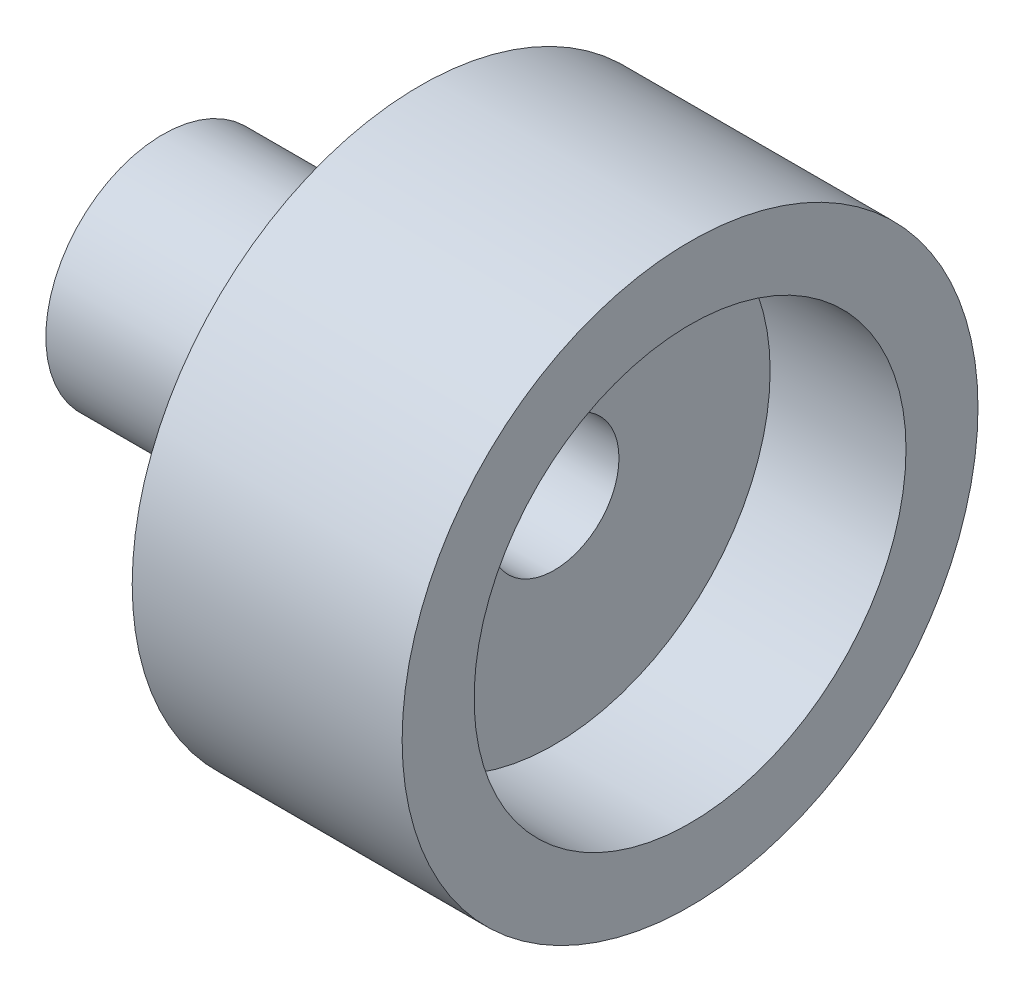
ISO-10303-21;
HEADER;
FILE_DESCRIPTION(('STEP AP214'),'2;1');
FILE_NAME('part.step','',(''),(''),'','','');
FILE_SCHEMA(('AUTOMOTIVE_DESIGN { 1 0 10303 214 1 1 1 1 }'));
ENDSEC;
DATA;
#1=APPLICATION_CONTEXT('core data for automotive mechanical design processes');
#2=APPLICATION_PROTOCOL_DEFINITION('international standard','automotive_design',2000,#1);
#3=PRODUCT_CONTEXT('',#1,'mechanical');
#4=PRODUCT('Part','Part','',(#3));
#5=PRODUCT_RELATED_PRODUCT_CATEGORY('part','',(#4));
#6=PRODUCT_DEFINITION_FORMATION('','',#4);
#7=PRODUCT_DEFINITION_CONTEXT('part definition',#1,'design');
#8=PRODUCT_DEFINITION('design','',#6,#7);
#9=PRODUCT_DEFINITION_SHAPE('','',#8);
#10=(LENGTH_UNIT() NAMED_UNIT(*) SI_UNIT(.MILLI.,.METRE.));
#11=(NAMED_UNIT(*) PLANE_ANGLE_UNIT() SI_UNIT($,.RADIAN.));
#12=(NAMED_UNIT(*) SI_UNIT($,.STERADIAN.) SOLID_ANGLE_UNIT());
#13=UNCERTAINTY_MEASURE_WITH_UNIT(LENGTH_MEASURE(1.E-05),#10,'distance_accuracy_value','');
#14=(GEOMETRIC_REPRESENTATION_CONTEXT(3) GLOBAL_UNCERTAINTY_ASSIGNED_CONTEXT((#13)) GLOBAL_UNIT_ASSIGNED_CONTEXT((#10,
#11,#12)) REPRESENTATION_CONTEXT('',''));
#15=CARTESIAN_POINT('',(0.,0.,0.));
#16=DIRECTION('',(0.,0.,1.));
#17=DIRECTION('',(1.,0.,0.));
#18=AXIS2_PLACEMENT_3D('',#15,#16,#17);
#19=CARTESIAN_POINT('',(7.5,0.,0.));
#20=DIRECTION('',(1.,0.,0.));
#21=DIRECTION('',(0.,0.,-1.));
#22=AXIS2_PLACEMENT_3D('',#19,#20,#21);
#23=PLANE('',#22);
#24=CARTESIAN_POINT('',(7.5,0.,0.));
#25=DIRECTION('',(1.,0.,0.));
#26=DIRECTION('',(0.,0.,-1.));
#27=AXIS2_PLACEMENT_3D('',#24,#25,#26);
#28=CIRCLE('',#27,6.);
#29=CARTESIAN_POINT('',(7.5,0.,-6.));
#30=VERTEX_POINT('',#29);
#31=EDGE_CURVE('E48',#30,#30,#28,.T.);
#32=ORIENTED_EDGE('',*,*,#31,.F.);
#33=EDGE_LOOP('',(#32));
#34=FACE_BOUND('',#33,.T.);
#35=CARTESIAN_POINT('',(7.5,0.,0.));
#36=DIRECTION('',(1.,0.,0.));
#37=DIRECTION('',(0.,0.,-1.));
#38=AXIS2_PLACEMENT_3D('',#35,#36,#37);
#39=CIRCLE('',#38,8.);
#40=CARTESIAN_POINT('',(7.5,0.,-8.));
#41=VERTEX_POINT('',#40);
#42=EDGE_CURVE('E10',#41,#41,#39,.T.);
#43=ORIENTED_EDGE('',*,*,#42,.T.);
#44=EDGE_LOOP('',(#43));
#45=FACE_BOUND('',#44,.T.);
#46=ADVANCED_FACE('F35',(#34,#45),#23,.T.);
#47=CARTESIAN_POINT('',(0.,0.,0.));
#48=DIRECTION('',(1.,0.,0.));
#49=DIRECTION('',(0.,0.,-1.));
#50=AXIS2_PLACEMENT_3D('',#47,#48,#49);
#51=PLANE('',#50);
#52=CARTESIAN_POINT('',(0.,0.,0.));
#53=DIRECTION('',(1.,0.,0.));
#54=DIRECTION('',(0.,0.,-1.));
#55=AXIS2_PLACEMENT_3D('',#52,#53,#54);
#56=CIRCLE('',#55,8.);
#57=CARTESIAN_POINT('',(0.,0.,-8.));
#58=VERTEX_POINT('',#57);
#59=EDGE_CURVE('E39',#58,#58,#56,.T.);
#60=ORIENTED_EDGE('',*,*,#59,.F.);
#61=EDGE_LOOP('',(#60));
#62=FACE_BOUND('',#61,.T.);
#63=CARTESIAN_POINT('',(0.,0.,0.));
#64=DIRECTION('',(1.,0.,0.));
#65=DIRECTION('',(0.,0.,-1.));
#66=AXIS2_PLACEMENT_3D('',#63,#64,#65);
#67=CIRCLE('',#66,3.25);
#68=CARTESIAN_POINT('',(0.,0.,-3.25));
#69=VERTEX_POINT('',#68);
#70=EDGE_CURVE('E51',#69,#69,#67,.T.);
#71=ORIENTED_EDGE('',*,*,#70,.T.);
#72=EDGE_LOOP('',(#71));
#73=FACE_BOUND('',#72,.T.);
#74=ADVANCED_FACE('F90',(#62,#73),#51,.F.);
#75=CARTESIAN_POINT('',(7.5,0.,0.));
#76=DIRECTION('',(-1.,0.,0.));
#77=DIRECTION('',(0.,0.,1.));
#78=AXIS2_PLACEMENT_3D('',#75,#76,#77);
#79=CYLINDRICAL_SURFACE('',#78,8.);
#80=ORIENTED_EDGE('',*,*,#42,.F.);
#81=EDGE_LOOP('',(#80));
#82=FACE_BOUND('',#81,.T.);
#83=ORIENTED_EDGE('',*,*,#59,.T.);
#84=EDGE_LOOP('',(#83));
#85=FACE_BOUND('',#84,.T.);
#86=ADVANCED_FACE('F37',(#82,#85),#79,.T.);
#87=CARTESIAN_POINT('',(3.725,0.,0.));
#88=DIRECTION('',(1.,0.,0.));
#89=DIRECTION('',(0.,0.,-1.));
#90=AXIS2_PLACEMENT_3D('',#87,#88,#89);
#91=CYLINDRICAL_SURFACE('',#90,6.);
#92=CARTESIAN_POINT('',(3.725,0.,0.));
#93=DIRECTION('',(1.,0.,0.));
#94=DIRECTION('',(0.,0.,-1.));
#95=AXIS2_PLACEMENT_3D('',#92,#93,#94);
#96=CIRCLE('',#95,6.);
#97=CARTESIAN_POINT('',(3.725,0.,-6.));
#98=VERTEX_POINT('',#97);
#99=EDGE_CURVE('E46',#98,#98,#96,.T.);
#100=ORIENTED_EDGE('',*,*,#99,.F.);
#101=EDGE_LOOP('',(#100));
#102=FACE_BOUND('',#101,.T.);
#103=ORIENTED_EDGE('',*,*,#31,.T.);
#104=EDGE_LOOP('',(#103));
#105=FACE_BOUND('',#104,.T.);
#106=ADVANCED_FACE('F78',(#102,#105),#91,.F.);
#107=CARTESIAN_POINT('',(3.725,0.,0.));
#108=DIRECTION('',(1.,0.,0.));
#109=DIRECTION('',(0.,0.,-1.));
#110=AXIS2_PLACEMENT_3D('',#107,#108,#109);
#111=PLANE('',#110);
#112=ORIENTED_EDGE('',*,*,#99,.T.);
#113=EDGE_LOOP('',(#112));
#114=FACE_BOUND('',#113,.T.);
#115=CARTESIAN_POINT('',(3.725,0.,0.));
#116=DIRECTION('',(1.,0.,0.));
#117=DIRECTION('',(0.,0.,-1.));
#118=AXIS2_PLACEMENT_3D('',#115,#116,#117);
#119=CIRCLE('',#118,1.8);
#120=CARTESIAN_POINT('',(3.725,0.,-1.8));
#121=VERTEX_POINT('',#120);
#122=EDGE_CURVE('E60',#121,#121,#119,.T.);
#123=ORIENTED_EDGE('',*,*,#122,.F.);
#124=EDGE_LOOP('',(#123));
#125=FACE_BOUND('',#124,.T.);
#126=ADVANCED_FACE('F75',(#114,#125),#111,.T.);
#127=CARTESIAN_POINT('',(-7.15,0.,0.));
#128=DIRECTION('',(1.,0.,0.));
#129=DIRECTION('',(0.,0.,-1.));
#130=AXIS2_PLACEMENT_3D('',#127,#128,#129);
#131=CYLINDRICAL_SURFACE('',#130,3.25);
#132=CARTESIAN_POINT('',(-7.15,0.,0.));
#133=DIRECTION('',(1.,0.,0.));
#134=DIRECTION('',(0.,0.,-1.));
#135=AXIS2_PLACEMENT_3D('',#132,#133,#134);
#136=CIRCLE('',#135,3.25);
#137=CARTESIAN_POINT('',(-7.15,0.,-3.25));
#138=VERTEX_POINT('',#137);
#139=EDGE_CURVE('E56',#138,#138,#136,.T.);
#140=ORIENTED_EDGE('',*,*,#139,.T.);
#141=EDGE_LOOP('',(#140));
#142=FACE_BOUND('',#141,.T.);
#143=ORIENTED_EDGE('',*,*,#70,.F.);
#144=EDGE_LOOP('',(#143));
#145=FACE_BOUND('',#144,.T.);
#146=ADVANCED_FACE('F77',(#142,#145),#131,.T.);
#147=CARTESIAN_POINT('',(-7.15,0.,0.));
#148=DIRECTION('',(1.,0.,0.));
#149=DIRECTION('',(0.,0.,-1.));
#150=AXIS2_PLACEMENT_3D('',#147,#148,#149);
#151=PLANE('',#150);
#152=CARTESIAN_POINT('',(-7.15,0.,0.));
#153=DIRECTION('',(1.,0.,0.));
#154=DIRECTION('',(0.,0.,-1.));
#155=AXIS2_PLACEMENT_3D('',#152,#153,#154);
#156=CIRCLE('',#155,1.8);
#157=CARTESIAN_POINT('',(-7.15,0.,-1.8));
#158=VERTEX_POINT('',#157);
#159=EDGE_CURVE('E59',#158,#158,#156,.T.);
#160=ORIENTED_EDGE('',*,*,#159,.T.);
#161=EDGE_LOOP('',(#160));
#162=FACE_BOUND('',#161,.T.);
#163=ORIENTED_EDGE('',*,*,#139,.F.);
#164=EDGE_LOOP('',(#163));
#165=FACE_BOUND('',#164,.T.);
#166=ADVANCED_FACE('F66',(#162,#165),#151,.F.);
#167=CARTESIAN_POINT('',(-7.15,0.,0.));
#168=DIRECTION('',(1.,0.,0.));
#169=DIRECTION('',(0.,0.,-1.));
#170=AXIS2_PLACEMENT_3D('',#167,#168,#169);
#171=CYLINDRICAL_SURFACE('',#170,1.8);
#172=ORIENTED_EDGE('',*,*,#159,.F.);
#173=EDGE_LOOP('',(#172));
#174=FACE_BOUND('',#173,.T.);
#175=ORIENTED_EDGE('',*,*,#122,.T.);
#176=EDGE_LOOP('',(#175));
#177=FACE_BOUND('',#176,.T.);
#178=ADVANCED_FACE('F69',(#174,#177),#171,.F.);
#179=CLOSED_SHELL('',(#46,#74,#86,#106,#126,#146,#166,#178));
#180=MANIFOLD_SOLID_BREP('B2',#179);
#181=ADVANCED_BREP_SHAPE_REPRESENTATION('',(#18,#180),#14);
#182=SHAPE_DEFINITION_REPRESENTATION(#9,#181);
ENDSEC;
END-ISO-10303-21;
